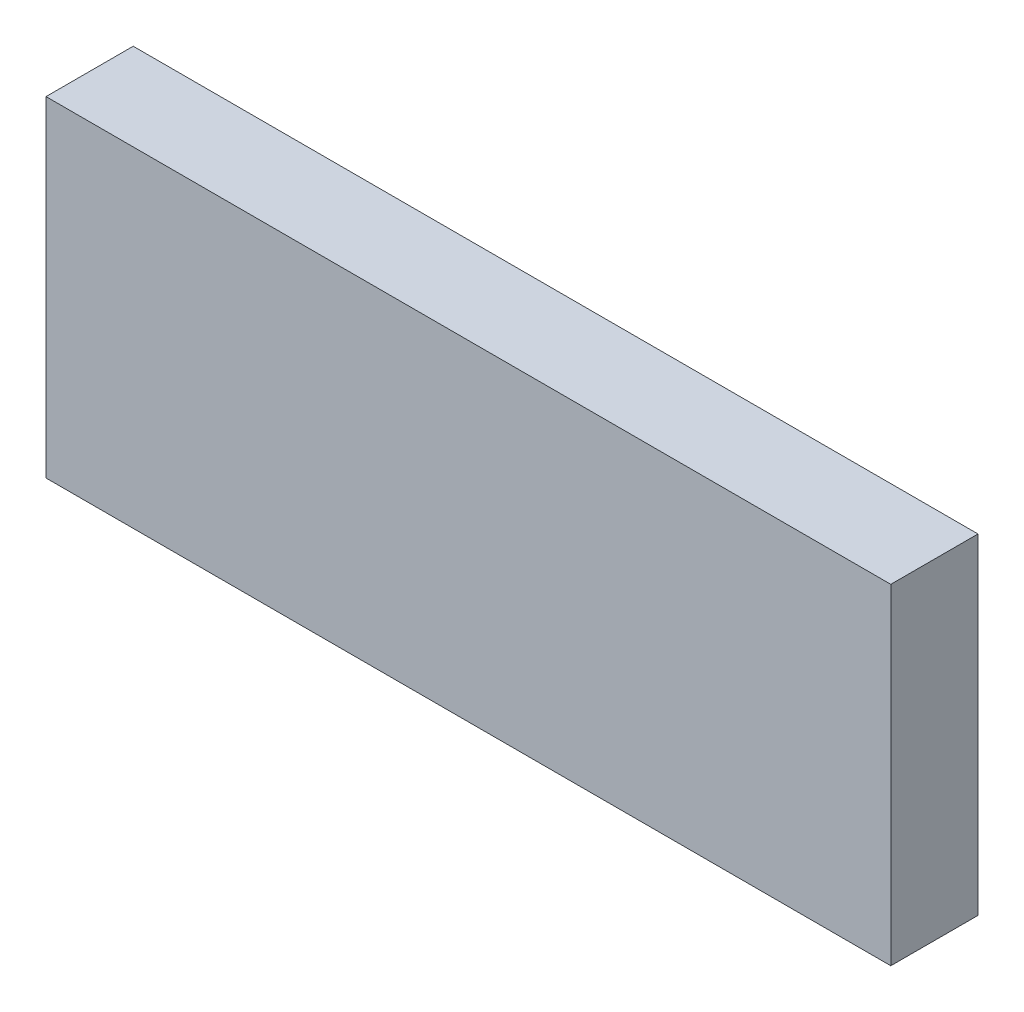
ISO-10303-21;
HEADER;
FILE_DESCRIPTION(('STEP AP214'),'2;1');
FILE_NAME('part.step','',(''),(''),'','','');
FILE_SCHEMA(('AUTOMOTIVE_DESIGN { 1 0 10303 214 1 1 1 1 }'));
ENDSEC;
DATA;
#1=APPLICATION_CONTEXT('core data for automotive mechanical design processes');
#2=APPLICATION_PROTOCOL_DEFINITION('international standard','automotive_design',2000,#1);
#3=PRODUCT_CONTEXT('',#1,'mechanical');
#4=PRODUCT('Part','Part','',(#3));
#5=PRODUCT_RELATED_PRODUCT_CATEGORY('part','',(#4));
#6=PRODUCT_DEFINITION_FORMATION('','',#4);
#7=PRODUCT_DEFINITION_CONTEXT('part definition',#1,'design');
#8=PRODUCT_DEFINITION('design','',#6,#7);
#9=PRODUCT_DEFINITION_SHAPE('','',#8);
#10=(LENGTH_UNIT() NAMED_UNIT(*) SI_UNIT(.MILLI.,.METRE.));
#11=(NAMED_UNIT(*) PLANE_ANGLE_UNIT() SI_UNIT($,.RADIAN.));
#12=(NAMED_UNIT(*) SI_UNIT($,.STERADIAN.) SOLID_ANGLE_UNIT());
#13=UNCERTAINTY_MEASURE_WITH_UNIT(LENGTH_MEASURE(1.E-05),#10,'distance_accuracy_value','');
#14=(GEOMETRIC_REPRESENTATION_CONTEXT(3) GLOBAL_UNCERTAINTY_ASSIGNED_CONTEXT((#13)) GLOBAL_UNIT_ASSIGNED_CONTEXT((#10,
#11,#12)) REPRESENTATION_CONTEXT('',''));
#15=CARTESIAN_POINT('',(0.,0.,0.));
#16=DIRECTION('',(0.,0.,1.));
#17=DIRECTION('',(1.,0.,0.));
#18=AXIS2_PLACEMENT_3D('',#15,#16,#17);
#19=CARTESIAN_POINT('',(1.59826706,-0.62500002,0.32999934));
#20=DIRECTION('',(0.,0.,1.));
#21=DIRECTION('',(1.,0.,0.));
#22=AXIS2_PLACEMENT_3D('',#19,#20,#21);
#23=PLANE('',#22);
#24=DIRECTION('',(0.,-1.,0.));
#25=VECTOR('',#24,1.);
#26=CARTESIAN_POINT('',(1.59826706,0.62500002,0.32999934));
#27=LINE('',#26,#25);
#28=CARTESIAN_POINT('',(1.59826706,0.62500002,0.32999934));
#29=VERTEX_POINT('',#28);
#30=CARTESIAN_POINT('',(1.59826706,-0.62500002,0.32999934));
#31=VERTEX_POINT('',#30);
#32=EDGE_CURVE('E28',#29,#31,#27,.T.);
#33=ORIENTED_EDGE('',*,*,#32,.F.);
#34=DIRECTION('',(1.,0.,0.));
#35=VECTOR('',#34,1.);
#36=CARTESIAN_POINT('',(-1.59826452,0.62500002,0.32999934));
#37=LINE('',#36,#35);
#38=CARTESIAN_POINT('',(-1.59826452,0.62500002,0.32999934));
#39=VERTEX_POINT('',#38);
#40=EDGE_CURVE('E67',#39,#29,#37,.T.);
#41=ORIENTED_EDGE('',*,*,#40,.F.);
#42=DIRECTION('',(0.,1.,0.));
#43=VECTOR('',#42,1.);
#44=CARTESIAN_POINT('',(-1.59826452,-0.62500002,0.32999934));
#45=LINE('',#44,#43);
#46=CARTESIAN_POINT('',(-1.59826452,-0.62500002,0.32999934));
#47=VERTEX_POINT('',#46);
#48=EDGE_CURVE('E71',#47,#39,#45,.T.);
#49=ORIENTED_EDGE('',*,*,#48,.F.);
#50=DIRECTION('',(-1.,0.,0.));
#51=VECTOR('',#50,1.);
#52=CARTESIAN_POINT('',(1.59826706,-0.62500002,0.32999934));
#53=LINE('',#52,#51);
#54=EDGE_CURVE('E108',#31,#47,#53,.T.);
#55=ORIENTED_EDGE('',*,*,#54,.F.);
#56=EDGE_LOOP('',(#33,#41,#49,#55));
#57=FACE_BOUND('',#56,.T.);
#58=ADVANCED_FACE('F17',(#57),#23,.T.);
#59=CARTESIAN_POINT('',(1.59826706,-0.62500002,0.));
#60=DIRECTION('',(0.,0.,1.));
#61=DIRECTION('',(1.,0.,0.));
#62=AXIS2_PLACEMENT_3D('',#59,#60,#61);
#63=PLANE('',#62);
#64=DIRECTION('',(-1.,0.,0.));
#65=VECTOR('',#64,1.);
#66=CARTESIAN_POINT('',(1.59826706,-0.62500002,0.));
#67=LINE('',#66,#65);
#68=CARTESIAN_POINT('',(1.59826706,-0.62500002,0.));
#69=VERTEX_POINT('',#68);
#70=CARTESIAN_POINT('',(-1.59826452,-0.62500002,0.));
#71=VERTEX_POINT('',#70);
#72=EDGE_CURVE('E92',#69,#71,#67,.T.);
#73=ORIENTED_EDGE('',*,*,#72,.T.);
#74=DIRECTION('',(0.,1.,0.));
#75=VECTOR('',#74,1.);
#76=CARTESIAN_POINT('',(-1.59826452,-0.62500002,0.));
#77=LINE('',#76,#75);
#78=CARTESIAN_POINT('',(-1.59826452,0.62500002,0.));
#79=VERTEX_POINT('',#78);
#80=EDGE_CURVE('E77',#71,#79,#77,.T.);
#81=ORIENTED_EDGE('',*,*,#80,.T.);
#82=DIRECTION('',(1.,0.,0.));
#83=VECTOR('',#82,1.);
#84=CARTESIAN_POINT('',(-1.59826452,0.62500002,0.));
#85=LINE('',#84,#83);
#86=CARTESIAN_POINT('',(1.59826706,0.62500002,0.));
#87=VERTEX_POINT('',#86);
#88=EDGE_CURVE('E82',#79,#87,#85,.T.);
#89=ORIENTED_EDGE('',*,*,#88,.T.);
#90=DIRECTION('',(0.,-1.,0.));
#91=VECTOR('',#90,1.);
#92=CARTESIAN_POINT('',(1.59826706,0.62500002,0.));
#93=LINE('',#92,#91);
#94=EDGE_CURVE('E11',#87,#69,#93,.T.);
#95=ORIENTED_EDGE('',*,*,#94,.T.);
#96=EDGE_LOOP('',(#73,#81,#89,#95));
#97=FACE_BOUND('',#96,.T.);
#98=ADVANCED_FACE('F161',(#97),#63,.F.);
#99=CARTESIAN_POINT('',(1.59826706,0.62500002,0.));
#100=DIRECTION('',(1.,0.,0.));
#101=DIRECTION('',(0.,1.,0.));
#102=AXIS2_PLACEMENT_3D('',#99,#100,#101);
#103=PLANE('',#102);
#104=DIRECTION('',(0.,0.,1.));
#105=VECTOR('',#104,1.);
#106=CARTESIAN_POINT('',(1.59826706,0.62500002,0.));
#107=LINE('',#106,#105);
#108=EDGE_CURVE('E76',#87,#29,#107,.T.);
#109=ORIENTED_EDGE('',*,*,#108,.T.);
#110=ORIENTED_EDGE('',*,*,#32,.T.);
#111=DIRECTION('',(0.,0.,1.));
#112=VECTOR('',#111,1.);
#113=CARTESIAN_POINT('',(1.59826706,-0.62500002,0.));
#114=LINE('',#113,#112);
#115=EDGE_CURVE('E21',#69,#31,#114,.T.);
#116=ORIENTED_EDGE('',*,*,#115,.F.);
#117=ORIENTED_EDGE('',*,*,#94,.F.);
#118=EDGE_LOOP('',(#109,#110,#116,#117));
#119=FACE_BOUND('',#118,.T.);
#120=ADVANCED_FACE('F19',(#119),#103,.T.);
#121=CARTESIAN_POINT('',(-1.59826452,0.62500002,0.));
#122=DIRECTION('',(0.,1.,0.));
#123=DIRECTION('',(1.,0.,0.));
#124=AXIS2_PLACEMENT_3D('',#121,#122,#123);
#125=PLANE('',#124);
#126=DIRECTION('',(0.,0.,1.));
#127=VECTOR('',#126,1.);
#128=CARTESIAN_POINT('',(-1.59826452,0.62500002,0.));
#129=LINE('',#128,#127);
#130=EDGE_CURVE('E80',#79,#39,#129,.T.);
#131=ORIENTED_EDGE('',*,*,#130,.T.);
#132=ORIENTED_EDGE('',*,*,#40,.T.);
#133=ORIENTED_EDGE('',*,*,#108,.F.);
#134=ORIENTED_EDGE('',*,*,#88,.F.);
#135=EDGE_LOOP('',(#131,#132,#133,#134));
#136=FACE_BOUND('',#135,.T.);
#137=ADVANCED_FACE('F81',(#136),#125,.T.);
#138=CARTESIAN_POINT('',(-1.59826452,-0.62500002,0.));
#139=DIRECTION('',(-1.,0.,0.));
#140=DIRECTION('',(0.,0.,1.));
#141=AXIS2_PLACEMENT_3D('',#138,#139,#140);
#142=PLANE('',#141);
#143=DIRECTION('',(0.,0.,1.));
#144=VECTOR('',#143,1.);
#145=CARTESIAN_POINT('',(-1.59826452,-0.62500002,0.));
#146=LINE('',#145,#144);
#147=EDGE_CURVE('E89',#71,#47,#146,.T.);
#148=ORIENTED_EDGE('',*,*,#147,.T.);
#149=ORIENTED_EDGE('',*,*,#48,.T.);
#150=ORIENTED_EDGE('',*,*,#130,.F.);
#151=ORIENTED_EDGE('',*,*,#80,.F.);
#152=EDGE_LOOP('',(#148,#149,#150,#151));
#153=FACE_BOUND('',#152,.T.);
#154=ADVANCED_FACE('F87',(#153),#142,.T.);
#155=CARTESIAN_POINT('',(1.59826706,-0.62500002,0.));
#156=DIRECTION('',(0.,-1.,0.));
#157=DIRECTION('',(0.,0.,-1.));
#158=AXIS2_PLACEMENT_3D('',#155,#156,#157);
#159=PLANE('',#158);
#160=ORIENTED_EDGE('',*,*,#115,.T.);
#161=ORIENTED_EDGE('',*,*,#54,.T.);
#162=ORIENTED_EDGE('',*,*,#147,.F.);
#163=ORIENTED_EDGE('',*,*,#72,.F.);
#164=EDGE_LOOP('',(#160,#161,#162,#163));
#165=FACE_BOUND('',#164,.T.);
#166=ADVANCED_FACE('F133',(#165),#159,.T.);
#167=CLOSED_SHELL('',(#58,#98,#120,#137,#154,#166));
#168=MANIFOLD_SOLID_BREP('B1',#167);
#169=ADVANCED_BREP_SHAPE_REPRESENTATION('',(#18,#168),#14);
#170=SHAPE_DEFINITION_REPRESENTATION(#9,#169);
ENDSEC;
END-ISO-10303-21;
